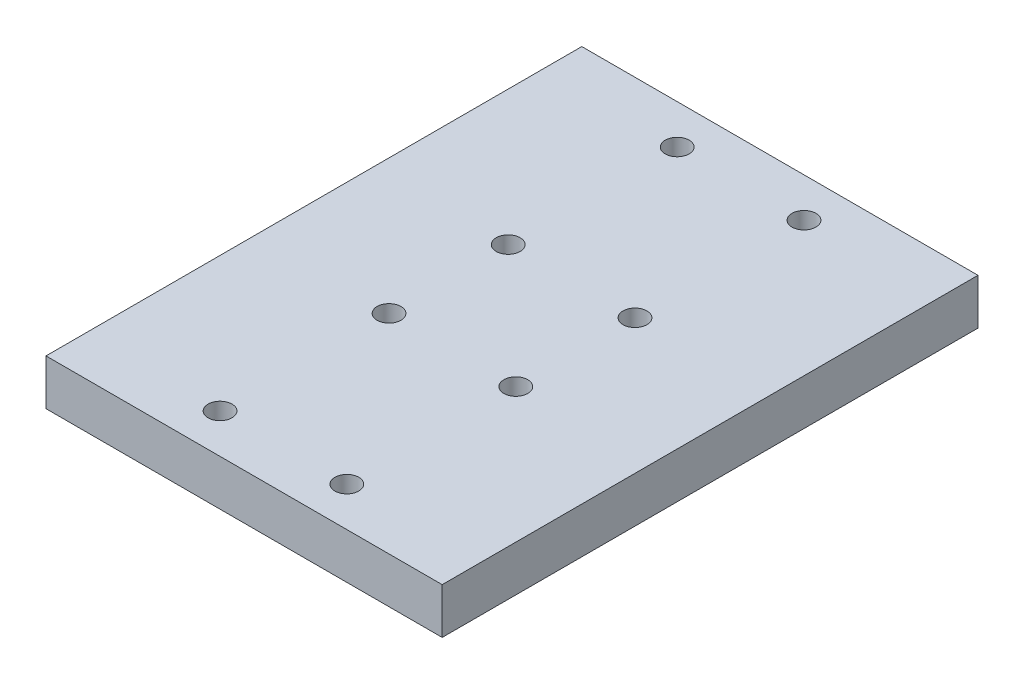
ISO-10303-21;
HEADER;
FILE_DESCRIPTION(('STEP AP214'),'2;1');
FILE_NAME('part.step','',(''),(''),'','','');
FILE_SCHEMA(('AUTOMOTIVE_DESIGN { 1 0 10303 214 1 1 1 1 }'));
ENDSEC;
DATA;
#1=APPLICATION_CONTEXT('core data for automotive mechanical design processes');
#2=APPLICATION_PROTOCOL_DEFINITION('international standard','automotive_design',2000,#1);
#3=PRODUCT_CONTEXT('',#1,'mechanical');
#4=PRODUCT('Part','Part','',(#3));
#5=PRODUCT_RELATED_PRODUCT_CATEGORY('part','',(#4));
#6=PRODUCT_DEFINITION_FORMATION('','',#4);
#7=PRODUCT_DEFINITION_CONTEXT('part definition',#1,'design');
#8=PRODUCT_DEFINITION('design','',#6,#7);
#9=PRODUCT_DEFINITION_SHAPE('','',#8);
#10=(LENGTH_UNIT() NAMED_UNIT(*) SI_UNIT(.MILLI.,.METRE.));
#11=(NAMED_UNIT(*) PLANE_ANGLE_UNIT() SI_UNIT($,.RADIAN.));
#12=(NAMED_UNIT(*) SI_UNIT($,.STERADIAN.) SOLID_ANGLE_UNIT());
#13=UNCERTAINTY_MEASURE_WITH_UNIT(LENGTH_MEASURE(1.E-05),#10,'distance_accuracy_value','');
#14=(GEOMETRIC_REPRESENTATION_CONTEXT(3) GLOBAL_UNCERTAINTY_ASSIGNED_CONTEXT((#13)) GLOBAL_UNIT_ASSIGNED_CONTEXT((#10,
#11,#12)) REPRESENTATION_CONTEXT('',''));
#15=CARTESIAN_POINT('',(0.,0.,0.));
#16=DIRECTION('',(0.,0.,1.));
#17=DIRECTION('',(1.,0.,0.));
#18=AXIS2_PLACEMENT_3D('',#15,#16,#17);
#19=CARTESIAN_POINT('',(0.,6.35,0.));
#20=DIRECTION('',(0.,-1.,0.));
#21=DIRECTION('',(0.,0.,-1.));
#22=AXIS2_PLACEMENT_3D('',#19,#20,#21);
#23=PLANE('',#22);
#24=DIRECTION('',(0.,0.,1.));
#25=VECTOR('',#24,1.);
#26=CARTESIAN_POINT('',(0.,6.35,0.));
#27=LINE('',#26,#25);
#28=CARTESIAN_POINT('',(0.,6.35,-74.38));
#29=VERTEX_POINT('',#28);
#30=CARTESIAN_POINT('',(0.,6.35,0.));
#31=VERTEX_POINT('',#30);
#32=EDGE_CURVE('E85',#29,#31,#27,.T.);
#33=ORIENTED_EDGE('',*,*,#32,.T.);
#34=DIRECTION('',(1.,0.,0.));
#35=VECTOR('',#34,1.);
#36=CARTESIAN_POINT('',(0.,6.35,0.));
#37=LINE('',#36,#35);
#38=CARTESIAN_POINT('',(55.,6.35,0.));
#39=VERTEX_POINT('',#38);
#40=EDGE_CURVE('E80',#31,#39,#37,.T.);
#41=ORIENTED_EDGE('',*,*,#40,.T.);
#42=DIRECTION('',(0.,0.,-1.));
#43=VECTOR('',#42,1.);
#44=CARTESIAN_POINT('',(55.,6.35,0.));
#45=LINE('',#44,#43);
#46=CARTESIAN_POINT('',(55.,6.35,-74.38));
#47=VERTEX_POINT('',#46);
#48=EDGE_CURVE('E83',#39,#47,#45,.T.);
#49=ORIENTED_EDGE('',*,*,#48,.T.);
#50=DIRECTION('',(-1.,0.,0.));
#51=VECTOR('',#50,1.);
#52=CARTESIAN_POINT('',(0.,6.35,-74.38));
#53=LINE('',#52,#51);
#54=EDGE_CURVE('E50',#47,#29,#53,.T.);
#55=ORIENTED_EDGE('',*,*,#54,.T.);
#56=EDGE_LOOP('',(#33,#41,#49,#55));
#57=FACE_BOUND('',#56,.T.);
#58=CARTESIAN_POINT('',(18.7,6.35,-68.92));
#59=DIRECTION('',(0.,1.,0.));
#60=DIRECTION('',(0.,0.,1.));
#61=AXIS2_PLACEMENT_3D('',#58,#59,#60);
#62=CIRCLE('',#61,1.66);
#63=CARTESIAN_POINT('',(18.7,6.35,-67.26));
#64=VERTEX_POINT('',#63);
#65=EDGE_CURVE('E100',#64,#64,#62,.T.);
#66=ORIENTED_EDGE('',*,*,#65,.F.);
#67=EDGE_LOOP('',(#66));
#68=FACE_BOUND('',#67,.T.);
#69=CARTESIAN_POINT('',(36.3,6.35,-68.92));
#70=DIRECTION('',(0.,1.,0.));
#71=DIRECTION('',(0.,0.,1.));
#72=AXIS2_PLACEMENT_3D('',#69,#70,#71);
#73=CIRCLE('',#72,1.66);
#74=CARTESIAN_POINT('',(36.3,6.35,-67.26));
#75=VERTEX_POINT('',#74);
#76=EDGE_CURVE('E115',#75,#75,#73,.T.);
#77=ORIENTED_EDGE('',*,*,#76,.F.);
#78=EDGE_LOOP('',(#77));
#79=FACE_BOUND('',#78,.T.);
#80=CARTESIAN_POINT('',(36.3,6.35,-45.46));
#81=DIRECTION('',(0.,1.,0.));
#82=DIRECTION('',(0.,0.,1.));
#83=AXIS2_PLACEMENT_3D('',#80,#81,#82);
#84=CIRCLE('',#83,1.66);
#85=CARTESIAN_POINT('',(36.3,6.35,-43.8));
#86=VERTEX_POINT('',#85);
#87=EDGE_CURVE('E121',#86,#86,#84,.T.);
#88=ORIENTED_EDGE('',*,*,#87,.F.);
#89=EDGE_LOOP('',(#88));
#90=FACE_BOUND('',#89,.T.);
#91=CARTESIAN_POINT('',(18.7,6.35,-45.46));
#92=DIRECTION('',(0.,1.,0.));
#93=DIRECTION('',(0.,0.,1.));
#94=AXIS2_PLACEMENT_3D('',#91,#92,#93);
#95=CIRCLE('',#94,1.66);
#96=CARTESIAN_POINT('',(18.7,6.35,-43.8));
#97=VERTEX_POINT('',#96);
#98=EDGE_CURVE('E127',#97,#97,#95,.T.);
#99=ORIENTED_EDGE('',*,*,#98,.F.);
#100=EDGE_LOOP('',(#99));
#101=FACE_BOUND('',#100,.T.);
#102=CARTESIAN_POINT('',(18.7,6.35,-28.92));
#103=DIRECTION('',(0.,1.,0.));
#104=DIRECTION('',(0.,0.,-1.));
#105=AXIS2_PLACEMENT_3D('',#102,#103,#104);
#106=CIRCLE('',#105,1.66);
#107=CARTESIAN_POINT('',(18.7,6.35,-30.58));
#108=VERTEX_POINT('',#107);
#109=EDGE_CURVE('E133',#108,#108,#106,.T.);
#110=ORIENTED_EDGE('',*,*,#109,.F.);
#111=EDGE_LOOP('',(#110));
#112=FACE_BOUND('',#111,.T.);
#113=CARTESIAN_POINT('',(36.3,6.35,-28.92));
#114=DIRECTION('',(0.,1.,0.));
#115=DIRECTION('',(0.,0.,-1.));
#116=AXIS2_PLACEMENT_3D('',#113,#114,#115);
#117=CIRCLE('',#116,1.66);
#118=CARTESIAN_POINT('',(36.3,6.35,-30.58));
#119=VERTEX_POINT('',#118);
#120=EDGE_CURVE('E139',#119,#119,#117,.T.);
#121=ORIENTED_EDGE('',*,*,#120,.F.);
#122=EDGE_LOOP('',(#121));
#123=FACE_BOUND('',#122,.T.);
#124=CARTESIAN_POINT('',(36.3,6.35,-5.45999999999999));
#125=DIRECTION('',(0.,1.,0.));
#126=DIRECTION('',(0.,0.,-1.));
#127=AXIS2_PLACEMENT_3D('',#124,#125,#126);
#128=CIRCLE('',#127,1.66);
#129=CARTESIAN_POINT('',(36.3,6.35,-7.11999999999999));
#130=VERTEX_POINT('',#129);
#131=EDGE_CURVE('E145',#130,#130,#128,.T.);
#132=ORIENTED_EDGE('',*,*,#131,.F.);
#133=EDGE_LOOP('',(#132));
#134=FACE_BOUND('',#133,.T.);
#135=CARTESIAN_POINT('',(18.7,6.35,-5.45999999999999));
#136=DIRECTION('',(0.,1.,0.));
#137=DIRECTION('',(0.,0.,-1.));
#138=AXIS2_PLACEMENT_3D('',#135,#136,#137);
#139=CIRCLE('',#138,1.66);
#140=CARTESIAN_POINT('',(18.7,6.35,-7.12));
#141=VERTEX_POINT('',#140);
#142=EDGE_CURVE('E151',#141,#141,#139,.T.);
#143=ORIENTED_EDGE('',*,*,#142,.F.);
#144=EDGE_LOOP('',(#143));
#145=FACE_BOUND('',#144,.T.);
#146=ADVANCED_FACE('F33',(#57,#68,#79,#90,#101,#112,#123,#134,#145),#23,.F.);
#147=CARTESIAN_POINT('',(0.,0.,0.));
#148=DIRECTION('',(0.,-1.,0.));
#149=DIRECTION('',(0.,0.,-1.));
#150=AXIS2_PLACEMENT_3D('',#147,#148,#149);
#151=PLANE('',#150);
#152=CARTESIAN_POINT('',(36.3,0.,-5.45999999999999));
#153=DIRECTION('',(0.,1.,0.));
#154=DIRECTION('',(0.,0.,-1.));
#155=AXIS2_PLACEMENT_3D('',#152,#153,#154);
#156=CIRCLE('',#155,1.66);
#157=CARTESIAN_POINT('',(36.3,0.,-7.11999999999999));
#158=VERTEX_POINT('',#157);
#159=EDGE_CURVE('E148',#158,#158,#156,.T.);
#160=ORIENTED_EDGE('',*,*,#159,.T.);
#161=EDGE_LOOP('',(#160));
#162=FACE_BOUND('',#161,.T.);
#163=CARTESIAN_POINT('',(18.7,0.,-28.92));
#164=DIRECTION('',(0.,1.,0.));
#165=DIRECTION('',(0.,0.,-1.));
#166=AXIS2_PLACEMENT_3D('',#163,#164,#165);
#167=CIRCLE('',#166,1.66);
#168=CARTESIAN_POINT('',(18.7,0.,-30.58));
#169=VERTEX_POINT('',#168);
#170=EDGE_CURVE('E136',#169,#169,#167,.T.);
#171=ORIENTED_EDGE('',*,*,#170,.T.);
#172=EDGE_LOOP('',(#171));
#173=FACE_BOUND('',#172,.T.);
#174=CARTESIAN_POINT('',(36.3,0.,-45.46));
#175=DIRECTION('',(0.,1.,0.));
#176=DIRECTION('',(0.,0.,1.));
#177=AXIS2_PLACEMENT_3D('',#174,#175,#176);
#178=CIRCLE('',#177,1.66);
#179=CARTESIAN_POINT('',(36.3,0.,-43.8));
#180=VERTEX_POINT('',#179);
#181=EDGE_CURVE('E124',#180,#180,#178,.T.);
#182=ORIENTED_EDGE('',*,*,#181,.T.);
#183=EDGE_LOOP('',(#182));
#184=FACE_BOUND('',#183,.T.);
#185=CARTESIAN_POINT('',(18.7,0.,-68.92));
#186=DIRECTION('',(0.,1.,0.));
#187=DIRECTION('',(0.,0.,1.));
#188=AXIS2_PLACEMENT_3D('',#185,#186,#187);
#189=CIRCLE('',#188,1.66);
#190=CARTESIAN_POINT('',(18.7,0.,-67.26));
#191=VERTEX_POINT('',#190);
#192=EDGE_CURVE('E112',#191,#191,#189,.T.);
#193=ORIENTED_EDGE('',*,*,#192,.T.);
#194=EDGE_LOOP('',(#193));
#195=FACE_BOUND('',#194,.T.);
#196=DIRECTION('',(0.,0.,1.));
#197=VECTOR('',#196,1.);
#198=CARTESIAN_POINT('',(0.,0.,0.));
#199=LINE('',#198,#197);
#200=CARTESIAN_POINT('',(0.,0.,-74.38));
#201=VERTEX_POINT('',#200);
#202=CARTESIAN_POINT('',(0.,0.,0.));
#203=VERTEX_POINT('',#202);
#204=EDGE_CURVE('E97',#201,#203,#199,.T.);
#205=ORIENTED_EDGE('',*,*,#204,.F.);
#206=DIRECTION('',(-1.,0.,0.));
#207=VECTOR('',#206,1.);
#208=CARTESIAN_POINT('',(0.,0.,-74.38));
#209=LINE('',#208,#207);
#210=CARTESIAN_POINT('',(55.,0.,-74.38));
#211=VERTEX_POINT('',#210);
#212=EDGE_CURVE('E73',#211,#201,#209,.T.);
#213=ORIENTED_EDGE('',*,*,#212,.F.);
#214=DIRECTION('',(0.,0.,-1.));
#215=VECTOR('',#214,1.);
#216=CARTESIAN_POINT('',(55.,0.,0.));
#217=LINE('',#216,#215);
#218=CARTESIAN_POINT('',(55.,0.,0.));
#219=VERTEX_POINT('',#218);
#220=EDGE_CURVE('E67',#219,#211,#217,.T.);
#221=ORIENTED_EDGE('',*,*,#220,.F.);
#222=DIRECTION('',(1.,0.,0.));
#223=VECTOR('',#222,1.);
#224=CARTESIAN_POINT('',(0.,0.,0.));
#225=LINE('',#224,#223);
#226=EDGE_CURVE('E89',#203,#219,#225,.T.);
#227=ORIENTED_EDGE('',*,*,#226,.F.);
#228=EDGE_LOOP('',(#205,#213,#221,#227));
#229=FACE_BOUND('',#228,.T.);
#230=CARTESIAN_POINT('',(36.3,0.,-68.92));
#231=DIRECTION('',(0.,1.,0.));
#232=DIRECTION('',(0.,0.,1.));
#233=AXIS2_PLACEMENT_3D('',#230,#231,#232);
#234=CIRCLE('',#233,1.66);
#235=CARTESIAN_POINT('',(36.3,0.,-67.26));
#236=VERTEX_POINT('',#235);
#237=EDGE_CURVE('E118',#236,#236,#234,.T.);
#238=ORIENTED_EDGE('',*,*,#237,.T.);
#239=EDGE_LOOP('',(#238));
#240=FACE_BOUND('',#239,.T.);
#241=CARTESIAN_POINT('',(18.7,0.,-45.46));
#242=DIRECTION('',(0.,1.,0.));
#243=DIRECTION('',(0.,0.,1.));
#244=AXIS2_PLACEMENT_3D('',#241,#242,#243);
#245=CIRCLE('',#244,1.66);
#246=CARTESIAN_POINT('',(18.7,0.,-43.8));
#247=VERTEX_POINT('',#246);
#248=EDGE_CURVE('E130',#247,#247,#245,.T.);
#249=ORIENTED_EDGE('',*,*,#248,.T.);
#250=EDGE_LOOP('',(#249));
#251=FACE_BOUND('',#250,.T.);
#252=CARTESIAN_POINT('',(36.3,0.,-28.92));
#253=DIRECTION('',(0.,1.,0.));
#254=DIRECTION('',(0.,0.,-1.));
#255=AXIS2_PLACEMENT_3D('',#252,#253,#254);
#256=CIRCLE('',#255,1.66);
#257=CARTESIAN_POINT('',(36.3,0.,-30.58));
#258=VERTEX_POINT('',#257);
#259=EDGE_CURVE('E142',#258,#258,#256,.T.);
#260=ORIENTED_EDGE('',*,*,#259,.T.);
#261=EDGE_LOOP('',(#260));
#262=FACE_BOUND('',#261,.T.);
#263=CARTESIAN_POINT('',(18.7,0.,-5.45999999999999));
#264=DIRECTION('',(0.,1.,0.));
#265=DIRECTION('',(0.,0.,-1.));
#266=AXIS2_PLACEMENT_3D('',#263,#264,#265);
#267=CIRCLE('',#266,1.66);
#268=CARTESIAN_POINT('',(18.7,0.,-7.12));
#269=VERTEX_POINT('',#268);
#270=EDGE_CURVE('E154',#269,#269,#267,.T.);
#271=ORIENTED_EDGE('',*,*,#270,.T.);
#272=EDGE_LOOP('',(#271));
#273=FACE_BOUND('',#272,.T.);
#274=ADVANCED_FACE('F108',(#162,#173,#184,#195,#229,#240,#251,#262,#273),#151,.T.);
#275=CARTESIAN_POINT('',(0.,6.35,0.));
#276=DIRECTION('',(1.,0.,0.));
#277=DIRECTION('',(0.,0.,-1.));
#278=AXIS2_PLACEMENT_3D('',#275,#276,#277);
#279=PLANE('',#278);
#280=ORIENTED_EDGE('',*,*,#204,.T.);
#281=DIRECTION('',(0.,-1.,0.));
#282=VECTOR('',#281,1.);
#283=CARTESIAN_POINT('',(0.,6.35,0.));
#284=LINE('',#283,#282);
#285=EDGE_CURVE('E11',#31,#203,#284,.T.);
#286=ORIENTED_EDGE('',*,*,#285,.F.);
#287=ORIENTED_EDGE('',*,*,#32,.F.);
#288=DIRECTION('',(0.,-1.,0.));
#289=VECTOR('',#288,1.);
#290=CARTESIAN_POINT('',(0.,6.35,-74.38));
#291=LINE('',#290,#289);
#292=EDGE_CURVE('E93',#29,#201,#291,.T.);
#293=ORIENTED_EDGE('',*,*,#292,.T.);
#294=EDGE_LOOP('',(#280,#286,#287,#293));
#295=FACE_BOUND('',#294,.T.);
#296=ADVANCED_FACE('F35',(#295),#279,.F.);
#297=CARTESIAN_POINT('',(0.,6.35,0.));
#298=DIRECTION('',(0.,0.,-1.));
#299=DIRECTION('',(-1.,0.,0.));
#300=AXIS2_PLACEMENT_3D('',#297,#298,#299);
#301=PLANE('',#300);
#302=ORIENTED_EDGE('',*,*,#226,.T.);
#303=DIRECTION('',(0.,-1.,0.));
#304=VECTOR('',#303,1.);
#305=CARTESIAN_POINT('',(55.,6.35,0.));
#306=LINE('',#305,#304);
#307=EDGE_CURVE('E42',#39,#219,#306,.T.);
#308=ORIENTED_EDGE('',*,*,#307,.F.);
#309=ORIENTED_EDGE('',*,*,#40,.F.);
#310=ORIENTED_EDGE('',*,*,#285,.T.);
#311=EDGE_LOOP('',(#302,#308,#309,#310));
#312=FACE_BOUND('',#311,.T.);
#313=ADVANCED_FACE('F88',(#312),#301,.F.);
#314=CARTESIAN_POINT('',(55.,6.35,0.));
#315=DIRECTION('',(-1.,0.,0.));
#316=DIRECTION('',(0.,0.,1.));
#317=AXIS2_PLACEMENT_3D('',#314,#315,#316);
#318=PLANE('',#317);
#319=ORIENTED_EDGE('',*,*,#220,.T.);
#320=DIRECTION('',(0.,-1.,0.));
#321=VECTOR('',#320,1.);
#322=CARTESIAN_POINT('',(55.,6.35,-74.38));
#323=LINE('',#322,#321);
#324=EDGE_CURVE('E90',#47,#211,#323,.T.);
#325=ORIENTED_EDGE('',*,*,#324,.F.);
#326=ORIENTED_EDGE('',*,*,#48,.F.);
#327=ORIENTED_EDGE('',*,*,#307,.T.);
#328=EDGE_LOOP('',(#319,#325,#326,#327));
#329=FACE_BOUND('',#328,.T.);
#330=ADVANCED_FACE('F91',(#329),#318,.F.);
#331=CARTESIAN_POINT('',(0.,6.35,-74.38));
#332=DIRECTION('',(0.,0.,1.));
#333=DIRECTION('',(1.,0.,0.));
#334=AXIS2_PLACEMENT_3D('',#331,#332,#333);
#335=PLANE('',#334);
#336=ORIENTED_EDGE('',*,*,#212,.T.);
#337=ORIENTED_EDGE('',*,*,#292,.F.);
#338=ORIENTED_EDGE('',*,*,#54,.F.);
#339=ORIENTED_EDGE('',*,*,#324,.T.);
#340=EDGE_LOOP('',(#336,#337,#338,#339));
#341=FACE_BOUND('',#340,.T.);
#342=ADVANCED_FACE('F105',(#341),#335,.F.);
#343=CARTESIAN_POINT('',(18.7,6.35,-68.92));
#344=DIRECTION('',(0.,-1.,0.));
#345=DIRECTION('',(0.,0.,-1.));
#346=AXIS2_PLACEMENT_3D('',#343,#344,#345);
#347=CYLINDRICAL_SURFACE('',#346,1.66);
#348=ORIENTED_EDGE('',*,*,#65,.T.);
#349=EDGE_LOOP('',(#348));
#350=FACE_BOUND('',#349,.T.);
#351=ORIENTED_EDGE('',*,*,#192,.F.);
#352=EDGE_LOOP('',(#351));
#353=FACE_BOUND('',#352,.T.);
#354=ADVANCED_FACE('F171',(#350,#353),#347,.F.);
#355=CARTESIAN_POINT('',(36.3,6.35,-68.92));
#356=DIRECTION('',(0.,-1.,0.));
#357=DIRECTION('',(0.,0.,-1.));
#358=AXIS2_PLACEMENT_3D('',#355,#356,#357);
#359=CYLINDRICAL_SURFACE('',#358,1.66);
#360=ORIENTED_EDGE('',*,*,#76,.T.);
#361=EDGE_LOOP('',(#360));
#362=FACE_BOUND('',#361,.T.);
#363=ORIENTED_EDGE('',*,*,#237,.F.);
#364=EDGE_LOOP('',(#363));
#365=FACE_BOUND('',#364,.T.);
#366=ADVANCED_FACE('F217',(#362,#365),#359,.F.);
#367=CARTESIAN_POINT('',(36.3,6.35,-45.46));
#368=DIRECTION('',(0.,-1.,0.));
#369=DIRECTION('',(0.,0.,-1.));
#370=AXIS2_PLACEMENT_3D('',#367,#368,#369);
#371=CYLINDRICAL_SURFACE('',#370,1.66);
#372=ORIENTED_EDGE('',*,*,#87,.T.);
#373=EDGE_LOOP('',(#372));
#374=FACE_BOUND('',#373,.T.);
#375=ORIENTED_EDGE('',*,*,#181,.F.);
#376=EDGE_LOOP('',(#375));
#377=FACE_BOUND('',#376,.T.);
#378=ADVANCED_FACE('F225',(#374,#377),#371,.F.);
#379=CARTESIAN_POINT('',(18.7,6.35,-45.46));
#380=DIRECTION('',(0.,-1.,0.));
#381=DIRECTION('',(0.,0.,-1.));
#382=AXIS2_PLACEMENT_3D('',#379,#380,#381);
#383=CYLINDRICAL_SURFACE('',#382,1.66);
#384=ORIENTED_EDGE('',*,*,#98,.T.);
#385=EDGE_LOOP('',(#384));
#386=FACE_BOUND('',#385,.T.);
#387=ORIENTED_EDGE('',*,*,#248,.F.);
#388=EDGE_LOOP('',(#387));
#389=FACE_BOUND('',#388,.T.);
#390=ADVANCED_FACE('F233',(#386,#389),#383,.F.);
#391=CARTESIAN_POINT('',(18.7,6.35,-28.92));
#392=DIRECTION('',(0.,-1.,0.));
#393=DIRECTION('',(0.,0.,-1.));
#394=AXIS2_PLACEMENT_3D('',#391,#392,#393);
#395=CYLINDRICAL_SURFACE('',#394,1.66);
#396=ORIENTED_EDGE('',*,*,#109,.T.);
#397=EDGE_LOOP('',(#396));
#398=FACE_BOUND('',#397,.T.);
#399=ORIENTED_EDGE('',*,*,#170,.F.);
#400=EDGE_LOOP('',(#399));
#401=FACE_BOUND('',#400,.T.);
#402=ADVANCED_FACE('F242',(#398,#401),#395,.F.);
#403=CARTESIAN_POINT('',(36.3,6.35,-28.92));
#404=DIRECTION('',(0.,-1.,0.));
#405=DIRECTION('',(0.,0.,-1.));
#406=AXIS2_PLACEMENT_3D('',#403,#404,#405);
#407=CYLINDRICAL_SURFACE('',#406,1.66);
#408=ORIENTED_EDGE('',*,*,#120,.T.);
#409=EDGE_LOOP('',(#408));
#410=FACE_BOUND('',#409,.T.);
#411=ORIENTED_EDGE('',*,*,#259,.F.);
#412=EDGE_LOOP('',(#411));
#413=FACE_BOUND('',#412,.T.);
#414=ADVANCED_FACE('F251',(#410,#413),#407,.F.);
#415=CARTESIAN_POINT('',(36.3,6.35,-5.45999999999999));
#416=DIRECTION('',(0.,-1.,0.));
#417=DIRECTION('',(0.,0.,-1.));
#418=AXIS2_PLACEMENT_3D('',#415,#416,#417);
#419=CYLINDRICAL_SURFACE('',#418,1.66);
#420=ORIENTED_EDGE('',*,*,#131,.T.);
#421=EDGE_LOOP('',(#420));
#422=FACE_BOUND('',#421,.T.);
#423=ORIENTED_EDGE('',*,*,#159,.F.);
#424=EDGE_LOOP('',(#423));
#425=FACE_BOUND('',#424,.T.);
#426=ADVANCED_FACE('F260',(#422,#425),#419,.F.);
#427=CARTESIAN_POINT('',(18.7,6.35,-5.45999999999999));
#428=DIRECTION('',(0.,-1.,0.));
#429=DIRECTION('',(0.,0.,-1.));
#430=AXIS2_PLACEMENT_3D('',#427,#428,#429);
#431=CYLINDRICAL_SURFACE('',#430,1.66);
#432=ORIENTED_EDGE('',*,*,#142,.T.);
#433=EDGE_LOOP('',(#432));
#434=FACE_BOUND('',#433,.T.);
#435=ORIENTED_EDGE('',*,*,#270,.F.);
#436=EDGE_LOOP('',(#435));
#437=FACE_BOUND('',#436,.T.);
#438=ADVANCED_FACE('F160',(#434,#437),#431,.F.);
#439=CLOSED_SHELL('',(#146,#274,#296,#313,#330,#342,#354,#366,#378,#390,#402,#414,#426,#438));
#440=MANIFOLD_SOLID_BREP('B2',#439);
#441=ADVANCED_BREP_SHAPE_REPRESENTATION('',(#18,#440),#14);
#442=SHAPE_DEFINITION_REPRESENTATION(#9,#441);
ENDSEC;
END-ISO-10303-21;
